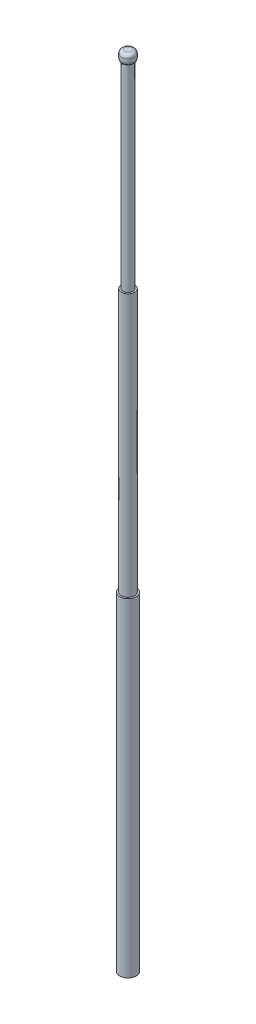
ISO-10303-21;
HEADER;
FILE_DESCRIPTION(('STEP AP214'),'2;1');
FILE_NAME('part.step','',(''),(''),'','','');
FILE_SCHEMA(('AUTOMOTIVE_DESIGN { 1 0 10303 214 1 1 1 1 }'));
ENDSEC;
DATA;
#1=APPLICATION_CONTEXT('core data for automotive mechanical design processes');
#2=APPLICATION_PROTOCOL_DEFINITION('international standard','automotive_design',2000,#1);
#3=PRODUCT_CONTEXT('',#1,'mechanical');
#4=PRODUCT('Part','Part','',(#3));
#5=PRODUCT_RELATED_PRODUCT_CATEGORY('part','',(#4));
#6=PRODUCT_DEFINITION_FORMATION('','',#4);
#7=PRODUCT_DEFINITION_CONTEXT('part definition',#1,'design');
#8=PRODUCT_DEFINITION('design','',#6,#7);
#9=PRODUCT_DEFINITION_SHAPE('','',#8);
#10=(LENGTH_UNIT() NAMED_UNIT(*) SI_UNIT(.MILLI.,.METRE.));
#11=(NAMED_UNIT(*) PLANE_ANGLE_UNIT() SI_UNIT($,.RADIAN.));
#12=(NAMED_UNIT(*) SI_UNIT($,.STERADIAN.) SOLID_ANGLE_UNIT());
#13=UNCERTAINTY_MEASURE_WITH_UNIT(LENGTH_MEASURE(1.E-05),#10,'distance_accuracy_value','');
#14=(GEOMETRIC_REPRESENTATION_CONTEXT(3) GLOBAL_UNCERTAINTY_ASSIGNED_CONTEXT((#13)) GLOBAL_UNIT_ASSIGNED_CONTEXT((#10,
#11,#12)) REPRESENTATION_CONTEXT('',''));
#15=CARTESIAN_POINT('',(0.,0.,0.));
#16=DIRECTION('',(0.,0.,1.));
#17=DIRECTION('',(1.,0.,0.));
#18=AXIS2_PLACEMENT_3D('',#15,#16,#17);
#19=CARTESIAN_POINT('',(0.,254.,0.));
#20=DIRECTION('',(0.,-1.,0.));
#21=DIRECTION('',(0.,0.,-1.));
#22=AXIS2_PLACEMENT_3D('',#19,#20,#21);
#23=CYLINDRICAL_SURFACE('',#22,6.35);
#24=CARTESIAN_POINT('',(0.,254.,0.));
#25=DIRECTION('',(0.,1.,0.));
#26=DIRECTION('',(0.,0.,1.));
#27=AXIS2_PLACEMENT_3D('',#24,#25,#26);
#28=CIRCLE('',#27,6.35);
#29=CARTESIAN_POINT('',(0.,254.,6.35));
#30=VERTEX_POINT('',#29);
#31=EDGE_CURVE('E52',#30,#30,#28,.T.);
#32=ORIENTED_EDGE('',*,*,#31,.F.);
#33=EDGE_LOOP('',(#32));
#34=FACE_BOUND('',#33,.T.);
#35=CARTESIAN_POINT('',(0.,0.,0.));
#36=DIRECTION('',(0.,1.,0.));
#37=DIRECTION('',(0.,0.,1.));
#38=AXIS2_PLACEMENT_3D('',#35,#36,#37);
#39=CIRCLE('',#38,6.35);
#40=CARTESIAN_POINT('',(0.,0.,6.35));
#41=VERTEX_POINT('',#40);
#42=EDGE_CURVE('E49',#41,#41,#39,.T.);
#43=ORIENTED_EDGE('',*,*,#42,.T.);
#44=EDGE_LOOP('',(#43));
#45=FACE_BOUND('',#44,.T.);
#46=ADVANCED_FACE('F31',(#34,#45),#23,.T.);
#47=CARTESIAN_POINT('',(0.,254.,0.));
#48=DIRECTION('',(0.,1.,0.));
#49=DIRECTION('',(0.,0.,1.));
#50=AXIS2_PLACEMENT_3D('',#47,#48,#49);
#51=PLANE('',#50);
#52=CARTESIAN_POINT('',(0.,254.,0.));
#53=DIRECTION('',(0.,1.,0.));
#54=DIRECTION('',(0.,0.,1.));
#55=AXIS2_PLACEMENT_3D('',#52,#53,#54);
#56=CIRCLE('',#55,5.08);
#57=CARTESIAN_POINT('',(0.,254.,5.08));
#58=VERTEX_POINT('',#57);
#59=EDGE_CURVE('E56',#58,#58,#56,.T.);
#60=ORIENTED_EDGE('',*,*,#59,.F.);
#61=EDGE_LOOP('',(#60));
#62=FACE_BOUND('',#61,.T.);
#63=ORIENTED_EDGE('',*,*,#31,.T.);
#64=EDGE_LOOP('',(#63));
#65=FACE_BOUND('',#64,.T.);
#66=ADVANCED_FACE('F89',(#62,#65),#51,.T.);
#67=CARTESIAN_POINT('',(0.,0.,0.));
#68=DIRECTION('',(0.,1.,0.));
#69=DIRECTION('',(0.,0.,1.));
#70=AXIS2_PLACEMENT_3D('',#67,#68,#69);
#71=PLANE('',#70);
#72=ORIENTED_EDGE('',*,*,#42,.F.);
#73=EDGE_LOOP('',(#72));
#74=FACE_BOUND('',#73,.T.);
#75=ADVANCED_FACE('F85',(#74),#71,.F.);
#76=CARTESIAN_POINT('',(0.,457.2,0.));
#77=DIRECTION('',(0.,-1.,0.));
#78=DIRECTION('',(0.,0.,-1.));
#79=AXIS2_PLACEMENT_3D('',#76,#77,#78);
#80=CYLINDRICAL_SURFACE('',#79,5.08);
#81=CARTESIAN_POINT('',(0.,457.2,0.));
#82=DIRECTION('',(0.,1.,0.));
#83=DIRECTION('',(0.,0.,1.));
#84=AXIS2_PLACEMENT_3D('',#81,#82,#83);
#85=CIRCLE('',#84,5.08);
#86=CARTESIAN_POINT('',(0.,457.2,5.08));
#87=VERTEX_POINT('',#86);
#88=EDGE_CURVE('E53',#87,#87,#85,.T.);
#89=ORIENTED_EDGE('',*,*,#88,.F.);
#90=EDGE_LOOP('',(#89));
#91=FACE_BOUND('',#90,.T.);
#92=ORIENTED_EDGE('',*,*,#59,.T.);
#93=EDGE_LOOP('',(#92));
#94=FACE_BOUND('',#93,.T.);
#95=ADVANCED_FACE('F79',(#91,#94),#80,.T.);
#96=CARTESIAN_POINT('',(0.,457.2,0.));
#97=DIRECTION('',(0.,1.,0.));
#98=DIRECTION('',(0.,0.,1.));
#99=AXIS2_PLACEMENT_3D('',#96,#97,#98);
#100=PLANE('',#99);
#101=CARTESIAN_POINT('',(0.,457.2,0.));
#102=DIRECTION('',(0.,1.,0.));
#103=DIRECTION('',(0.,0.,1.));
#104=AXIS2_PLACEMENT_3D('',#101,#102,#103);
#105=CIRCLE('',#104,3.81);
#106=CARTESIAN_POINT('',(0.,457.2,-3.81));
#107=VERTEX_POINT('',#106);
#108=EDGE_CURVE('E46',#107,#107,#105,.T.);
#109=ORIENTED_EDGE('',*,*,#108,.F.);
#110=EDGE_LOOP('',(#109));
#111=FACE_BOUND('',#110,.T.);
#112=ORIENTED_EDGE('',*,*,#88,.T.);
#113=EDGE_LOOP('',(#112));
#114=FACE_BOUND('',#113,.T.);
#115=ADVANCED_FACE('F73',(#111,#114),#100,.T.);
#116=CARTESIAN_POINT('',(0.,609.6,0.));
#117=DIRECTION('',(0.,-1.,0.));
#118=DIRECTION('',(0.,0.,-1.));
#119=AXIS2_PLACEMENT_3D('',#116,#117,#118);
#120=CYLINDRICAL_SURFACE('',#119,3.81);
#121=CARTESIAN_POINT('',(0.,609.6,0.));
#122=DIRECTION('',(0.,1.,0.));
#123=DIRECTION('',(0.,0.,1.));
#124=AXIS2_PLACEMENT_3D('',#121,#122,#123);
#125=CIRCLE('',#124,3.81);
#126=CARTESIAN_POINT('',(0.,609.6,-3.81));
#127=VERTEX_POINT('',#126);
#128=EDGE_CURVE('E61',#127,#127,#125,.T.);
#129=CARTESIAN_POINT('',(0.,609.6,-3.81));
#130=CARTESIAN_POINT('',(0.,608.0125,-3.81));
#131=CARTESIAN_POINT('',(0.,606.425,-3.81));
#132=CARTESIAN_POINT('',(0.,603.25,-3.81));
#133=CARTESIAN_POINT('',(0.,601.6625,-3.81));
#134=CARTESIAN_POINT('',(0.,598.4875,-3.81));
#135=CARTESIAN_POINT('',(0.,596.9,-3.81));
#136=CARTESIAN_POINT('',(0.,593.725,-3.81));
#137=CARTESIAN_POINT('',(0.,592.1375,-3.81));
#138=CARTESIAN_POINT('',(0.,588.9625,-3.81));
#139=CARTESIAN_POINT('',(0.,587.375,-3.81));
#140=CARTESIAN_POINT('',(0.,584.2,-3.81));
#141=CARTESIAN_POINT('',(0.,582.6125,-3.81));
#142=CARTESIAN_POINT('',(0.,579.4375,-3.81));
#143=CARTESIAN_POINT('',(0.,577.85,-3.81));
#144=CARTESIAN_POINT('',(0.,574.675,-3.81));
#145=CARTESIAN_POINT('',(0.,573.0875,-3.81));
#146=CARTESIAN_POINT('',(0.,569.9125,-3.81));
#147=CARTESIAN_POINT('',(0.,568.325,-3.81));
#148=CARTESIAN_POINT('',(0.,565.15,-3.81));
#149=CARTESIAN_POINT('',(0.,563.5625,-3.81));
#150=CARTESIAN_POINT('',(0.,560.3875,-3.81));
#151=CARTESIAN_POINT('',(0.,558.8,-3.81));
#152=CARTESIAN_POINT('',(0.,555.625,-3.81));
#153=CARTESIAN_POINT('',(0.,554.0375,-3.81));
#154=CARTESIAN_POINT('',(0.,550.8625,-3.81));
#155=CARTESIAN_POINT('',(0.,549.275,-3.81));
#156=CARTESIAN_POINT('',(0.,546.1,-3.81));
#157=CARTESIAN_POINT('',(0.,544.5125,-3.81));
#158=CARTESIAN_POINT('',(0.,541.3375,-3.81));
#159=CARTESIAN_POINT('',(0.,539.75,-3.81));
#160=CARTESIAN_POINT('',(0.,536.575,-3.81));
#161=CARTESIAN_POINT('',(0.,534.9875,-3.81));
#162=CARTESIAN_POINT('',(0.,531.8125,-3.81));
#163=CARTESIAN_POINT('',(0.,530.225,-3.81));
#164=CARTESIAN_POINT('',(0.,527.05,-3.81));
#165=CARTESIAN_POINT('',(0.,525.4625,-3.81));
#166=CARTESIAN_POINT('',(0.,522.2875,-3.81));
#167=CARTESIAN_POINT('',(0.,520.7,-3.81));
#168=CARTESIAN_POINT('',(0.,517.525,-3.81));
#169=CARTESIAN_POINT('',(0.,515.9375,-3.81));
#170=CARTESIAN_POINT('',(0.,512.7625,-3.81));
#171=CARTESIAN_POINT('',(0.,511.175,-3.81));
#172=CARTESIAN_POINT('',(0.,508.,-3.81));
#173=CARTESIAN_POINT('',(0.,506.4125,-3.81));
#174=CARTESIAN_POINT('',(0.,503.2375,-3.81));
#175=CARTESIAN_POINT('',(0.,501.65,-3.81));
#176=CARTESIAN_POINT('',(0.,498.475,-3.81));
#177=CARTESIAN_POINT('',(0.,496.8875,-3.81));
#178=CARTESIAN_POINT('',(0.,493.7125,-3.81));
#179=CARTESIAN_POINT('',(0.,492.125,-3.81));
#180=CARTESIAN_POINT('',(0.,488.95,-3.81));
#181=CARTESIAN_POINT('',(0.,487.3625,-3.81));
#182=CARTESIAN_POINT('',(0.,484.1875,-3.81));
#183=CARTESIAN_POINT('',(0.,482.6,-3.81));
#184=CARTESIAN_POINT('',(0.,479.425,-3.81));
#185=CARTESIAN_POINT('',(0.,477.8375,-3.81));
#186=CARTESIAN_POINT('',(0.,474.6625,-3.81));
#187=CARTESIAN_POINT('',(0.,473.075,-3.81));
#188=CARTESIAN_POINT('',(0.,469.9,-3.81));
#189=CARTESIAN_POINT('',(0.,468.3125,-3.81));
#190=CARTESIAN_POINT('',(0.,465.1375,-3.81));
#191=CARTESIAN_POINT('',(0.,463.55,-3.81));
#192=CARTESIAN_POINT('',(0.,460.375,-3.81));
#193=CARTESIAN_POINT('',(0.,458.7875,-3.81));
#194=CARTESIAN_POINT('',(0.,457.2,-3.81));
#195=B_SPLINE_CURVE_WITH_KNOTS('',3,(#129,#130,#131,#132,#133,#134,#135,#136,#137,#138,#139,
#140,#141,#142,#143,#144,#145,#146,#147,#148,#149,#150,#151,#152,#153,#154,#155,#156,#157,#158,
#159,#160,#161,#162,#163,#164,#165,#166,#167,#168,#169,#170,#171,#172,#173,#174,#175,#176,#177,
#178,#179,#180,#181,#182,#183,#184,#185,#186,#187,#188,#189,#190,#191,#192,#193,#194),
.UNSPECIFIED.,.F.,.F.,(4,2,2,2,2,2,2,2,2,2,2,2,2,2,2,2,2,2,2,2,2,2,2,2,2,2,2,2,2,2,2,2,4),(0.,
4.7625,9.52500000000001,14.2875,19.05,23.8125,28.575,33.3375,38.1,42.8625,47.625,52.3875,57.15,
61.9125,66.675,71.4375,76.2,80.9625,85.7250000000001,90.4875000000001,95.2500000000001,100.0125,
104.775,109.5375,114.3,119.0625,123.825,128.5875,133.35,138.1125,142.875,147.6375,152.4),.UNSPECIFIED.);
#196=EDGE_CURVE('BSEAM69',#127,#107,#195,.T.);
#197=ORIENTED_EDGE('',*,*,#128,.F.);
#198=ORIENTED_EDGE('',*,*,#108,.T.);
#199=ORIENTED_EDGE('',*,*,#196,.T.);
#200=ORIENTED_EDGE('',*,*,#196,.F.);
#201=EDGE_LOOP('',(#197,#199,#198,#200));
#202=FACE_BOUND('',#201,.T.);
#203=ADVANCED_FACE('F69',(#202),#120,.T.);
#204=CARTESIAN_POINT('',(0.,617.22,0.));
#205=DIRECTION('',(0.,-1.,0.));
#206=DIRECTION('',(0.,0.,-1.));
#207=AXIS2_PLACEMENT_3D('',#204,#205,#206);
#208=CYLINDRICAL_SURFACE('',#207,5.08);
#209=CARTESIAN_POINT('',(0.,614.68,0.));
#210=DIRECTION('',(0.,1.,0.));
#211=DIRECTION('',(0.,0.,1.));
#212=AXIS2_PLACEMENT_3D('',#209,#210,#211);
#213=CIRCLE('',#212,5.08);
#214=CARTESIAN_POINT('',(0.,614.68,5.08));
#215=VERTEX_POINT('',#214);
#216=EDGE_CURVE('E10',#215,#215,#213,.F.);
#217=ORIENTED_EDGE('',*,*,#216,.T.);
#218=EDGE_LOOP('',(#217));
#219=FACE_BOUND('',#218,.T.);
#220=CARTESIAN_POINT('',(0.,611.799704525612,0.));
#221=DIRECTION('',(0.,-1.,0.));
#222=DIRECTION('',(0.,0.,-1.));
#223=AXIS2_PLACEMENT_3D('',#220,#221,#222);
#224=CIRCLE('',#223,5.08);
#225=CARTESIAN_POINT('',(0.,611.799704525612,-5.08));
#226=VERTEX_POINT('',#225);
#227=EDGE_CURVE('E38',#226,#226,#224,.F.);
#228=ORIENTED_EDGE('',*,*,#227,.T.);
#229=EDGE_LOOP('',(#228));
#230=FACE_BOUND('',#229,.T.);
#231=ADVANCED_FACE('F72',(#219,#230),#208,.T.);
#232=CARTESIAN_POINT('',(0.,617.22,0.));
#233=DIRECTION('',(0.,1.,0.));
#234=DIRECTION('',(0.,0.,1.));
#235=AXIS2_PLACEMENT_3D('',#232,#233,#234);
#236=PLANE('',#235);
#237=CARTESIAN_POINT('',(0.,617.22,0.));
#238=DIRECTION('',(0.,1.,0.));
#239=DIRECTION('',(0.,0.,1.));
#240=AXIS2_PLACEMENT_3D('',#237,#238,#239);
#241=CIRCLE('',#240,2.54);
#242=CARTESIAN_POINT('',(0.,617.22,2.54));
#243=VERTEX_POINT('',#242);
#244=EDGE_CURVE('E42',#243,#243,#241,.T.);
#245=ORIENTED_EDGE('',*,*,#244,.T.);
#246=EDGE_LOOP('',(#245));
#247=FACE_BOUND('',#246,.T.);
#248=ADVANCED_FACE('F106',(#247),#236,.T.);
#249=CARTESIAN_POINT('',(0.,614.68,0.));
#250=DIRECTION('',(0.,1.,0.));
#251=DIRECTION('',(0.,0.,1.));
#252=AXIS2_PLACEMENT_3D('',#249,#250,#251);
#253=DEGENERATE_TOROIDAL_SURFACE('',#252,2.54,2.54,.T.);
#254=ORIENTED_EDGE('',*,*,#216,.F.);
#255=EDGE_LOOP('',(#254));
#256=FACE_BOUND('',#255,.T.);
#257=ORIENTED_EDGE('',*,*,#244,.F.);
#258=EDGE_LOOP('',(#257));
#259=FACE_BOUND('',#258,.T.);
#260=ADVANCED_FACE('F104',(#256,#259),#253,.T.);
#261=CARTESIAN_POINT('',(0.,611.799704525612,0.));
#262=DIRECTION('',(0.,-1.,0.));
#263=DIRECTION('',(0.,0.,-1.));
#264=AXIS2_PLACEMENT_3D('',#261,#262,#263);
#265=DEGENERATE_TOROIDAL_SURFACE('',#264,2.54,2.54,.T.);
#266=ORIENTED_EDGE('',*,*,#128,.T.);
#267=EDGE_LOOP('',(#266));
#268=FACE_BOUND('',#267,.T.);
#269=ORIENTED_EDGE('',*,*,#227,.F.);
#270=EDGE_LOOP('',(#269));
#271=FACE_BOUND('',#270,.T.);
#272=ADVANCED_FACE('F33',(#268,#271),#265,.T.);
#273=CLOSED_SHELL('',(#46,#66,#75,#95,#115,#203,#231,#248,#260,#272));
#274=MANIFOLD_SOLID_BREP('B2',#273);
#275=ADVANCED_BREP_SHAPE_REPRESENTATION('',(#18,#274),#14);
#276=SHAPE_DEFINITION_REPRESENTATION(#9,#275);
ENDSEC;
END-ISO-10303-21;
